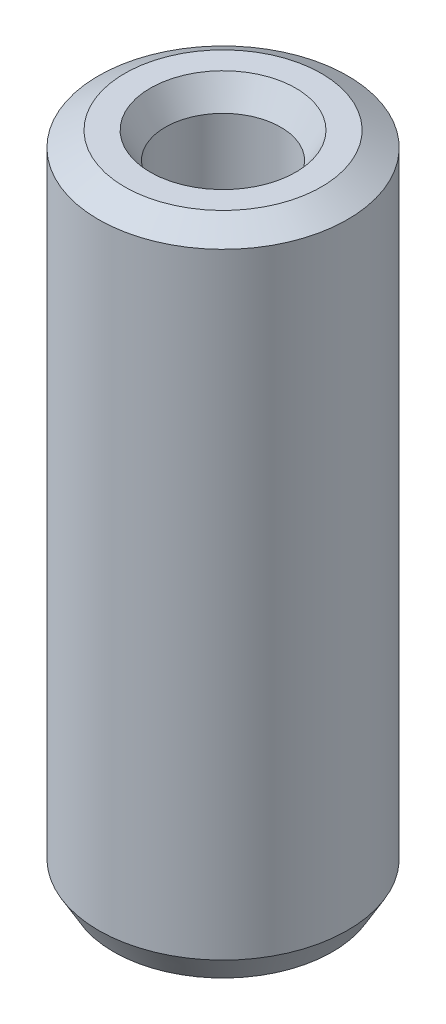
ISO-10303-21;
HEADER;
FILE_DESCRIPTION(('STEP AP214'),'2;1');
FILE_NAME('part.step','',(''),(''),'','','');
FILE_SCHEMA(('AUTOMOTIVE_DESIGN { 1 0 10303 214 1 1 1 1 }'));
ENDSEC;
DATA;
#1=APPLICATION_CONTEXT('core data for automotive mechanical design processes');
#2=APPLICATION_PROTOCOL_DEFINITION('international standard','automotive_design',2000,#1);
#3=PRODUCT_CONTEXT('',#1,'mechanical');
#4=PRODUCT('Part','Part','',(#3));
#5=PRODUCT_RELATED_PRODUCT_CATEGORY('part','',(#4));
#6=PRODUCT_DEFINITION_FORMATION('','',#4);
#7=PRODUCT_DEFINITION_CONTEXT('part definition',#1,'design');
#8=PRODUCT_DEFINITION('design','',#6,#7);
#9=PRODUCT_DEFINITION_SHAPE('','',#8);
#10=(LENGTH_UNIT() NAMED_UNIT(*) SI_UNIT(.MILLI.,.METRE.));
#11=(NAMED_UNIT(*) PLANE_ANGLE_UNIT() SI_UNIT($,.RADIAN.));
#12=(NAMED_UNIT(*) SI_UNIT($,.STERADIAN.) SOLID_ANGLE_UNIT());
#13=UNCERTAINTY_MEASURE_WITH_UNIT(LENGTH_MEASURE(1.E-05),#10,'distance_accuracy_value','');
#14=(GEOMETRIC_REPRESENTATION_CONTEXT(3) GLOBAL_UNCERTAINTY_ASSIGNED_CONTEXT((#13)) GLOBAL_UNIT_ASSIGNED_CONTEXT((#10,
#11,#12)) REPRESENTATION_CONTEXT('',''));
#15=CARTESIAN_POINT('',(0.,0.,0.));
#16=DIRECTION('',(0.,0.,1.));
#17=DIRECTION('',(1.,0.,0.));
#18=AXIS2_PLACEMENT_3D('',#15,#16,#17);
#19=CARTESIAN_POINT('',(0.,92.2959480847912,0.));
#20=DIRECTION('',(0.,-1.,0.));
#21=DIRECTION('',(0.,0.,-1.));
#22=AXIS2_PLACEMENT_3D('',#19,#20,#21);
#23=CYLINDRICAL_SURFACE('',#22,17.5);
#24=CARTESIAN_POINT('',(0.,3.68195964660158,0.));
#25=DIRECTION('',(0.,1.,0.));
#26=DIRECTION('',(0.,0.,1.));
#27=AXIS2_PLACEMENT_3D('',#24,#25,#26);
#28=CIRCLE('',#27,17.5);
#29=CARTESIAN_POINT('',(0.,3.68195964660158,17.5));
#30=VERTEX_POINT('',#29);
#31=EDGE_CURVE('E10',#30,#30,#28,.T.);
#32=ORIENTED_EDGE('',*,*,#31,.T.);
#33=EDGE_LOOP('',(#32));
#34=FACE_BOUND('',#33,.T.);
#35=CARTESIAN_POINT('',(0.,90.1701676916804,0.));
#36=DIRECTION('',(0.,1.,0.));
#37=DIRECTION('',(0.,0.,1.));
#38=AXIS2_PLACEMENT_3D('',#35,#36,#37);
#39=CIRCLE('',#38,17.5);
#40=CARTESIAN_POINT('',(0.,90.1701676916804,17.5));
#41=VERTEX_POINT('',#40);
#42=EDGE_CURVE('E50',#41,#41,#39,.F.);
#43=ORIENTED_EDGE('',*,*,#42,.T.);
#44=EDGE_LOOP('',(#43));
#45=FACE_BOUND('',#44,.T.);
#46=ADVANCED_FACE('F39',(#34,#45),#23,.T.);
#47=CARTESIAN_POINT('',(0.,92.2959480847912,0.));
#48=DIRECTION('',(0.,1.,0.));
#49=DIRECTION('',(0.,0.,1.));
#50=AXIS2_PLACEMENT_3D('',#47,#48,#49);
#51=PLANE('',#50);
#52=CARTESIAN_POINT('',(0.,92.2959480847912,0.));
#53=DIRECTION('',(0.,1.,0.));
#54=DIRECTION('',(0.,0.,1.));
#55=AXIS2_PLACEMENT_3D('',#52,#53,#54);
#56=CIRCLE('',#55,10.2304584763153);
#57=CARTESIAN_POINT('',(0.,92.2959480847912,10.2304584763153));
#58=VERTEX_POINT('',#57);
#59=EDGE_CURVE('E58',#58,#58,#56,.F.);
#60=ORIENTED_EDGE('',*,*,#59,.T.);
#61=EDGE_LOOP('',(#60));
#62=FACE_BOUND('',#61,.T.);
#63=CARTESIAN_POINT('',(0.,92.2959480847912,0.));
#64=DIRECTION('',(0.,1.,0.));
#65=DIRECTION('',(0.,0.,1.));
#66=AXIS2_PLACEMENT_3D('',#63,#64,#65);
#67=CIRCLE('',#66,13.8180403533984);
#68=CARTESIAN_POINT('',(0.,92.2959480847912,13.8180403533984));
#69=VERTEX_POINT('',#68);
#70=EDGE_CURVE('E61',#69,#69,#67,.T.);
#71=ORIENTED_EDGE('',*,*,#70,.T.);
#72=EDGE_LOOP('',(#71));
#73=FACE_BOUND('',#72,.T.);
#74=ADVANCED_FACE('F88',(#62,#73),#51,.T.);
#75=CARTESIAN_POINT('',(0.,0.,0.));
#76=DIRECTION('',(0.,1.,0.));
#77=DIRECTION('',(0.,0.,1.));
#78=AXIS2_PLACEMENT_3D('',#75,#76,#77);
#79=PLANE('',#78);
#80=CARTESIAN_POINT('',(0.,0.,0.));
#81=DIRECTION('',(0.,1.,0.));
#82=DIRECTION('',(0.,0.,1.));
#83=AXIS2_PLACEMENT_3D('',#80,#81,#82);
#84=CIRCLE('',#83,11.7866377298061);
#85=CARTESIAN_POINT('',(0.,0.,11.7866377298061));
#86=VERTEX_POINT('',#85);
#87=EDGE_CURVE('E51',#86,#86,#84,.T.);
#88=ORIENTED_EDGE('',*,*,#87,.T.);
#89=EDGE_LOOP('',(#88));
#90=FACE_BOUND('',#89,.T.);
#91=CARTESIAN_POINT('',(0.,0.,0.));
#92=DIRECTION('',(0.,1.,0.));
#93=DIRECTION('',(0.,0.,1.));
#94=AXIS2_PLACEMENT_3D('',#91,#92,#93);
#95=CIRCLE('',#94,15.3742196068892);
#96=CARTESIAN_POINT('',(0.,0.,15.3742196068892));
#97=VERTEX_POINT('',#96);
#98=EDGE_CURVE('E54',#97,#97,#95,.F.);
#99=ORIENTED_EDGE('',*,*,#98,.T.);
#100=EDGE_LOOP('',(#99));
#101=FACE_BOUND('',#100,.T.);
#102=ADVANCED_FACE('F83',(#90,#101),#79,.F.);
#103=CARTESIAN_POINT('',(0.,92.2959480847912,0.));
#104=DIRECTION('',(0.,-1.,0.));
#105=DIRECTION('',(0.,0.,-1.));
#106=AXIS2_PLACEMENT_3D('',#103,#104,#105);
#107=CYLINDRICAL_SURFACE('',#106,8.10467808320448);
#108=CARTESIAN_POINT('',(0.,88.6139884381896,0.));
#109=DIRECTION('',(0.,1.,0.));
#110=DIRECTION('',(0.,0.,1.));
#111=AXIS2_PLACEMENT_3D('',#108,#109,#110);
#112=CIRCLE('',#111,8.10467808320448);
#113=CARTESIAN_POINT('',(0.,88.6139884381896,8.10467808320448));
#114=VERTEX_POINT('',#113);
#115=EDGE_CURVE('E67',#114,#114,#112,.T.);
#116=ORIENTED_EDGE('',*,*,#115,.T.);
#117=EDGE_LOOP('',(#116));
#118=FACE_BOUND('',#117,.T.);
#119=CARTESIAN_POINT('',(0.,2.1257803931108,0.));
#120=DIRECTION('',(0.,1.,0.));
#121=DIRECTION('',(0.,0.,1.));
#122=AXIS2_PLACEMENT_3D('',#119,#120,#121);
#123=CIRCLE('',#122,8.10467808320448);
#124=CARTESIAN_POINT('',(0.,2.1257803931108,8.10467808320448));
#125=VERTEX_POINT('',#124);
#126=EDGE_CURVE('E69',#125,#125,#123,.F.);
#127=ORIENTED_EDGE('',*,*,#126,.T.);
#128=EDGE_LOOP('',(#127));
#129=FACE_BOUND('',#128,.T.);
#130=ADVANCED_FACE('F71',(#118,#129),#107,.F.);
#131=CARTESIAN_POINT('',(0.,88.6139884381896,0.));
#132=DIRECTION('',(0.,1.,0.));
#133=DIRECTION('',(0.,0.,1.));
#134=AXIS2_PLACEMENT_3D('',#131,#132,#133);
#135=CONICAL_SURFACE('',#134,8.10467808320448,0.523598775598304);
#136=CARTESIAN_POINT('',(0.,92.2959480847912,10.2304584763153));
#137=CARTESIAN_POINT('',(0.,92.2575943384725,10.2083149305537));
#138=CARTESIAN_POINT('',(0.,92.2192405921537,10.1861713847922));
#139=CARTESIAN_POINT('',(0.,92.1425330995162,10.141884293269));
#140=CARTESIAN_POINT('',(0.,92.1041793531974,10.1197407475074));
#141=CARTESIAN_POINT('',(0.,92.0274718605599,10.0754536559843));
#142=CARTESIAN_POINT('',(0.,91.9891181142411,10.0533101102227));
#143=CARTESIAN_POINT('',(0.,91.9124106216036,10.0090230186996));
#144=CARTESIAN_POINT('',(0.,91.8740568752848,9.98687947293801));
#145=CARTESIAN_POINT('',(0.,91.7973493826473,9.94259238141487));
#146=CARTESIAN_POINT('',(0.,91.7589956363285,9.9204488356533));
#147=CARTESIAN_POINT('',(0.,91.682288143691,9.87616174413016));
#148=CARTESIAN_POINT('',(0.,91.6439343973722,9.85401819836859));
#149=CARTESIAN_POINT('',(0.,91.5672269047347,9.80973110684544));
#150=CARTESIAN_POINT('',(0.,91.5288731584159,9.78758756108387));
#151=CARTESIAN_POINT('',(0.,91.4521656657784,9.74330046956073));
#152=CARTESIAN_POINT('',(0.,91.4138119194596,9.72115692379916));
#153=CARTESIAN_POINT('',(0.,91.3371044268221,9.67686983227602));
#154=CARTESIAN_POINT('',(0.,91.2987506805033,9.65472628651445));
#155=CARTESIAN_POINT('',(0.,91.2220431878658,9.61043919499131));
#156=CARTESIAN_POINT('',(0.,91.183689441547,9.58829564922973));
#157=CARTESIAN_POINT('',(0.,91.1069819489094,9.54400855770659));
#158=CARTESIAN_POINT('',(0.,91.0686282025907,9.52186501194502));
#159=CARTESIAN_POINT('',(0.,90.9919207099531,9.47757792042188));
#160=CARTESIAN_POINT('',(0.,90.9535669636344,9.45543437466031));
#161=CARTESIAN_POINT('',(0.,90.8768594709968,9.41114728313717));
#162=CARTESIAN_POINT('',(0.,90.8385057246781,9.3890037373756));
#163=CARTESIAN_POINT('',(0.,90.7617982320405,9.34471664585245));
#164=CARTESIAN_POINT('',(0.,90.7234444857218,9.32257310009088));
#165=CARTESIAN_POINT('',(0.,90.6467369930842,9.27828600856774));
#166=CARTESIAN_POINT('',(0.,90.6083832467655,9.25614246280617));
#167=CARTESIAN_POINT('',(0.,90.5316757541279,9.21185537128303));
#168=CARTESIAN_POINT('',(0.,90.4933220078092,9.18971182552146));
#169=CARTESIAN_POINT('',(0.,90.4166145151716,9.14542473399831));
#170=CARTESIAN_POINT('',(0.,90.3782607688529,9.12328118823674));
#171=CARTESIAN_POINT('',(0.,90.3015532762153,9.0789940967136));
#172=CARTESIAN_POINT('',(0.,90.2631995298966,9.05685055095203));
#173=CARTESIAN_POINT('',(0.,90.186492037259,9.01256345942889));
#174=CARTESIAN_POINT('',(0.,90.1481382909403,8.99041991366732));
#175=CARTESIAN_POINT('',(0.,90.0714307983027,8.94613282214418));
#176=CARTESIAN_POINT('',(0.,90.033077051984,8.9239892763826));
#177=CARTESIAN_POINT('',(0.,89.9563695593464,8.87970218485946));
#178=CARTESIAN_POINT('',(0.,89.9180158130277,8.85755863909789));
#179=CARTESIAN_POINT('',(0.,89.8413083203901,8.81327154757475));
#180=CARTESIAN_POINT('',(0.,89.8029545740714,8.79112800181318));
#181=CARTESIAN_POINT('',(0.,89.7262470814338,8.74684091029004));
#182=CARTESIAN_POINT('',(0.,89.6878933351151,8.72469736452847));
#183=CARTESIAN_POINT('',(0.,89.6111858424775,8.68041027300533));
#184=CARTESIAN_POINT('',(0.,89.5728320961588,8.65826672724375));
#185=CARTESIAN_POINT('',(0.,89.4961246035212,8.61397963572061));
#186=CARTESIAN_POINT('',(0.,89.4577708572025,8.59183608995904));
#187=CARTESIAN_POINT('',(0.,89.3810633645649,8.54754899843589));
#188=CARTESIAN_POINT('',(0.,89.3427096182462,8.52540545267433));
#189=CARTESIAN_POINT('',(0.,89.2660021256086,8.48111836115118));
#190=CARTESIAN_POINT('',(0.,89.2276483792899,8.45897481538961));
#191=CARTESIAN_POINT('',(0.,89.1509408866523,8.41468772386647));
#192=CARTESIAN_POINT('',(0.,89.1125871403336,8.3925441781049));
#193=CARTESIAN_POINT('',(0.,89.035879647696,8.34825708658176));
#194=CARTESIAN_POINT('',(0.,88.9975259013773,8.32611354082019));
#195=CARTESIAN_POINT('',(0.,88.9208184087397,8.28182644929704));
#196=CARTESIAN_POINT('',(0.,88.882464662421,8.25968290353547));
#197=CARTESIAN_POINT('',(0.,88.8057571697834,8.21539581201233));
#198=CARTESIAN_POINT('',(0.,88.7674034234647,8.19325226625076));
#199=CARTESIAN_POINT('',(0.,88.6906959308271,8.14896517472762));
#200=CARTESIAN_POINT('',(0.,88.6523421845084,8.12682162896605));
#201=CARTESIAN_POINT('',(0.,88.6139884381896,8.10467808320448));
#202=B_SPLINE_CURVE_WITH_KNOTS('',3,(#136,#137,#138,#139,#140,#141,#142,#143,#144,#145,#146,
#147,#148,#149,#150,#151,#152,#153,#154,#155,#156,#157,#158,#159,#160,#161,#162,#163,#164,#165,
#166,#167,#168,#169,#170,#171,#172,#173,#174,#175,#176,#177,#178,#179,#180,#181,#182,#183,#184,
#185,#186,#187,#188,#189,#190,#191,#192,#193,#194,#195,#196,#197,#198,#199,#200,#201),
.UNSPECIFIED.,.F.,.F.,(4,2,2,2,2,2,2,2,2,2,2,2,2,2,2,2,2,2,2,2,2,2,2,2,2,2,2,2,2,2,2,2,4),(0.,
0.132861274569435,0.265722549138858,0.398583823708281,0.531445098277704,0.664306372847127,
0.79716764741655,0.930028921985985,1.06289019655541,1.19575147112483,1.32861274569425,
1.46147402026368,1.5943352948331,1.72719656940253,1.86005784397196,1.99291911854138,
2.1257803931108,2.25864166768023,2.39150294224965,2.52436421681907,2.65722549138851,
2.79008676595793,2.92294804052735,3.05580931509678,3.1886705896662,3.32153186423562,
3.45439313880506,3.58725441337448,3.7201156879439,3.85297696251333,3.98583823708275,
4.11869951165217,4.25156078622159),.UNSPECIFIED.);
#203=EDGE_CURVE('BSEAM77',#58,#114,#202,.T.);
#204=ORIENTED_EDGE('',*,*,#59,.F.);
#205=ORIENTED_EDGE('',*,*,#115,.F.);
#206=ORIENTED_EDGE('',*,*,#203,.T.);
#207=ORIENTED_EDGE('',*,*,#203,.F.);
#208=EDGE_LOOP('',(#204,#206,#205,#207));
#209=FACE_BOUND('',#208,.T.);
#210=ADVANCED_FACE('F77',(#209),#135,.F.);
#211=CARTESIAN_POINT('',(0.,0.,0.));
#212=DIRECTION('',(0.,-1.,0.));
#213=DIRECTION('',(0.,0.,-1.));
#214=AXIS2_PLACEMENT_3D('',#211,#212,#213);
#215=CONICAL_SURFACE('',#214,11.7866377298061,1.04719755119659);
#216=ORIENTED_EDGE('',*,*,#126,.F.);
#217=EDGE_LOOP('',(#216));
#218=FACE_BOUND('',#217,.T.);
#219=ORIENTED_EDGE('',*,*,#87,.F.);
#220=EDGE_LOOP('',(#219));
#221=FACE_BOUND('',#220,.T.);
#222=ADVANCED_FACE('F73',(#218,#221),#215,.F.);
#223=CARTESIAN_POINT('',(0.,3.68195964660158,0.));
#224=DIRECTION('',(0.,1.,0.));
#225=DIRECTION('',(0.,0.,1.));
#226=AXIS2_PLACEMENT_3D('',#223,#224,#225);
#227=CONICAL_SURFACE('',#226,17.5,0.523598775598301);
#228=CARTESIAN_POINT('',(0.,0.,15.3742196068892));
#229=CARTESIAN_POINT('',(0.,0.0383537463187661,15.3963631526508));
#230=CARTESIAN_POINT('',(0.,0.0767074926375326,15.4185066984124));
#231=CARTESIAN_POINT('',(0.,0.153414985275065,15.4627937899355));
#232=CARTESIAN_POINT('',(0.,0.191768731593832,15.4849373356971));
#233=CARTESIAN_POINT('',(0.,0.268476224231364,15.5292244272202));
#234=CARTESIAN_POINT('',(0.,0.306829970550131,15.5513679729818));
#235=CARTESIAN_POINT('',(0.,0.383537463187664,15.5956550645049));
#236=CARTESIAN_POINT('',(0.,0.42189120950643,15.6177986102665));
#237=CARTESIAN_POINT('',(0.,0.498598702143963,15.6620857017896));
#238=CARTESIAN_POINT('',(0.,0.536952448462729,15.6842292475512));
#239=CARTESIAN_POINT('',(0.,0.613659941100262,15.7285163390744));
#240=CARTESIAN_POINT('',(0.,0.652013687419029,15.7506598848359));
#241=CARTESIAN_POINT('',(0.,0.728721180056562,15.7949469763591));
#242=CARTESIAN_POINT('',(0.,0.767074926375329,15.8170905221206));
#243=CARTESIAN_POINT('',(0.,0.843782419012861,15.8613776136438));
#244=CARTESIAN_POINT('',(0.,0.882136165331627,15.8835211594054));
#245=CARTESIAN_POINT('',(0.,0.95884365796916,15.9278082509285));
#246=CARTESIAN_POINT('',(0.,0.997197404287927,15.9499517966901));
#247=CARTESIAN_POINT('',(0.,1.07390489692546,15.9942388882132));
#248=CARTESIAN_POINT('',(0.,1.11225864324423,16.0163824339748));
#249=CARTESIAN_POINT('',(0.,1.18896613588176,16.0606695254979));
#250=CARTESIAN_POINT('',(0.,1.22731988220053,16.0828130712595));
#251=CARTESIAN_POINT('',(0.,1.30402737483806,16.1271001627826));
#252=CARTESIAN_POINT('',(0.,1.34238112115682,16.1492437085442));
#253=CARTESIAN_POINT('',(0.,1.41908861379436,16.1935308000673));
#254=CARTESIAN_POINT('',(0.,1.45744236011312,16.2156743458289));
#255=CARTESIAN_POINT('',(0.,1.53414985275066,16.2599614373521));
#256=CARTESIAN_POINT('',(0.,1.57250359906942,16.2821049831136));
#257=CARTESIAN_POINT('',(0.,1.64921109170696,16.3263920746368));
#258=CARTESIAN_POINT('',(0.,1.68756483802572,16.3485356203983));
#259=CARTESIAN_POINT('',(0.,1.76427233066326,16.3928227119215));
#260=CARTESIAN_POINT('',(0.,1.80262607698202,16.4149662576831));
#261=CARTESIAN_POINT('',(0.,1.87933356961955,16.4592533492062));
#262=CARTESIAN_POINT('',(0.,1.91768731593832,16.4813968949678));
#263=CARTESIAN_POINT('',(0.,1.99439480857585,16.5256839864909));
#264=CARTESIAN_POINT('',(0.,2.03274855489462,16.5478275322525));
#265=CARTESIAN_POINT('',(0.,2.10945604753215,16.5921146237756));
#266=CARTESIAN_POINT('',(0.,2.14780979385092,16.6142581695372));
#267=CARTESIAN_POINT('',(0.,2.22451728648845,16.6585452610603));
#268=CARTESIAN_POINT('',(0.,2.26287103280722,16.6806888068219));
#269=CARTESIAN_POINT('',(0.,2.33957852544475,16.724975898345));
#270=CARTESIAN_POINT('',(0.,2.37793227176352,16.7471194441066));
#271=CARTESIAN_POINT('',(0.,2.45463976440105,16.7914065356297));
#272=CARTESIAN_POINT('',(0.,2.49299351071982,16.8135500813913));
#273=CARTESIAN_POINT('',(0.,2.56970100335735,16.8578371729145));
#274=CARTESIAN_POINT('',(0.,2.60805474967612,16.879980718676));
#275=CARTESIAN_POINT('',(0.,2.68476224231365,16.9242678101992));
#276=CARTESIAN_POINT('',(0.,2.72311598863242,16.9464113559607));
#277=CARTESIAN_POINT('',(0.,2.79982348126995,16.9906984474839));
#278=CARTESIAN_POINT('',(0.,2.83817722758871,17.0128419932455));
#279=CARTESIAN_POINT('',(0.,2.91488472022625,17.0571290847686));
#280=CARTESIAN_POINT('',(0.,2.95323846654501,17.0792726305302));
#281=CARTESIAN_POINT('',(0.,3.02994595918255,17.1235597220533));
#282=CARTESIAN_POINT('',(0.,3.06829970550131,17.1457032678149));
#283=CARTESIAN_POINT('',(0.,3.14500719813885,17.189990359338));
#284=CARTESIAN_POINT('',(0.,3.18336094445761,17.2121339050996));
#285=CARTESIAN_POINT('',(0.,3.26006843709515,17.2564209966227));
#286=CARTESIAN_POINT('',(0.,3.29842218341391,17.2785645423843));
#287=CARTESIAN_POINT('',(0.,3.37512967605144,17.3228516339074));
#288=CARTESIAN_POINT('',(0.,3.41348342237021,17.344995179669));
#289=CARTESIAN_POINT('',(0.,3.49019091500774,17.3892822711922));
#290=CARTESIAN_POINT('',(0.,3.52854466132651,17.4114258169537));
#291=CARTESIAN_POINT('',(0.,3.60525215396404,17.4557129084769));
#292=CARTESIAN_POINT('',(0.,3.64360590028281,17.4778564542384));
#293=CARTESIAN_POINT('',(0.,3.68195964660158,17.5));
#294=B_SPLINE_CURVE_WITH_KNOTS('',3,(#228,#229,#230,#231,#232,#233,#234,#235,#236,#237,#238,
#239,#240,#241,#242,#243,#244,#245,#246,#247,#248,#249,#250,#251,#252,#253,#254,#255,#256,#257,
#258,#259,#260,#261,#262,#263,#264,#265,#266,#267,#268,#269,#270,#271,#272,#273,#274,#275,#276,
#277,#278,#279,#280,#281,#282,#283,#284,#285,#286,#287,#288,#289,#290,#291,#292,#293),
.UNSPECIFIED.,.F.,.F.,(4,2,2,2,2,2,2,2,2,2,2,2,2,2,2,2,2,2,2,2,2,2,2,2,2,2,2,2,2,2,2,2,4),(0.,
0.132861274569422,0.265722549138845,0.398583823708268,0.53144509827769,0.664306372847114,
0.797167647416536,0.930028921985958,1.06289019655538,1.1957514711248,1.32861274569423,
1.46147402026365,1.59433529483307,1.72719656940249,1.86005784397192,1.99291911854134,
2.12578039311076,2.25864166768019,2.39150294224961,2.52436421681903,2.65722549138845,
2.79008676595787,2.9229480405273,3.05580931509672,3.18867058966614,3.32153186423557,
3.45439313880499,3.58725441337441,3.72011568794384,3.85297696251326,3.98583823708268,
4.1186995116521,4.25156078622152),.UNSPECIFIED.);
#295=EDGE_CURVE('BSEAM76',#97,#30,#294,.T.);
#296=ORIENTED_EDGE('',*,*,#98,.F.);
#297=ORIENTED_EDGE('',*,*,#31,.F.);
#298=ORIENTED_EDGE('',*,*,#295,.T.);
#299=ORIENTED_EDGE('',*,*,#295,.F.);
#300=EDGE_LOOP('',(#296,#298,#297,#299));
#301=FACE_BOUND('',#300,.T.);
#302=ADVANCED_FACE('F76',(#301),#227,.T.);
#303=CARTESIAN_POINT('',(0.,92.2959480847912,0.));
#304=DIRECTION('',(0.,-1.,0.));
#305=DIRECTION('',(0.,0.,-1.));
#306=AXIS2_PLACEMENT_3D('',#303,#304,#305);
#307=CONICAL_SURFACE('',#306,13.8180403533984,1.04719755119659);
#308=ORIENTED_EDGE('',*,*,#42,.F.);
#309=EDGE_LOOP('',(#308));
#310=FACE_BOUND('',#309,.T.);
#311=ORIENTED_EDGE('',*,*,#70,.F.);
#312=EDGE_LOOP('',(#311));
#313=FACE_BOUND('',#312,.T.);
#314=ADVANCED_FACE('F45',(#310,#313),#307,.T.);
#315=CLOSED_SHELL('',(#46,#74,#102,#130,#210,#222,#302,#314));
#316=MANIFOLD_SOLID_BREP('B2',#315);
#317=ADVANCED_BREP_SHAPE_REPRESENTATION('',(#18,#316),#14);
#318=SHAPE_DEFINITION_REPRESENTATION(#9,#317);
ENDSEC;
END-ISO-10303-21;
